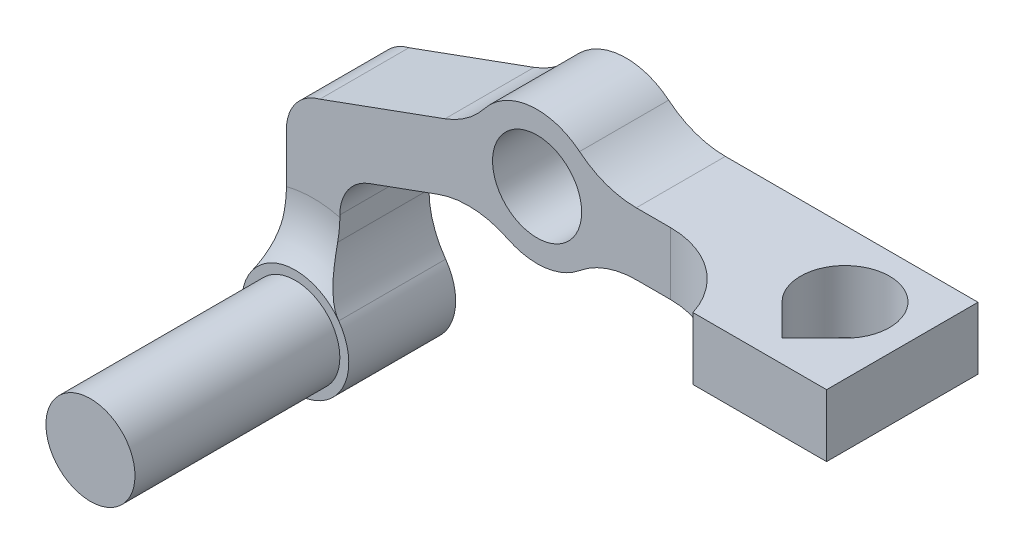
ISO-10303-21;
HEADER;
FILE_DESCRIPTION(('STEP AP214'),'2;1');
FILE_NAME('part.step','',(''),(''),'','','');
FILE_SCHEMA(('AUTOMOTIVE_DESIGN { 1 0 10303 214 1 1 1 1 }'));
ENDSEC;
DATA;
#1=APPLICATION_CONTEXT('core data for automotive mechanical design processes');
#2=APPLICATION_PROTOCOL_DEFINITION('international standard','automotive_design',2000,#1);
#3=PRODUCT_CONTEXT('',#1,'mechanical');
#4=PRODUCT('Part','Part','',(#3));
#5=PRODUCT_RELATED_PRODUCT_CATEGORY('part','',(#4));
#6=PRODUCT_DEFINITION_FORMATION('','',#4);
#7=PRODUCT_DEFINITION_CONTEXT('part definition',#1,'design');
#8=PRODUCT_DEFINITION('design','',#6,#7);
#9=PRODUCT_DEFINITION_SHAPE('','',#8);
#10=(LENGTH_UNIT() NAMED_UNIT(*) SI_UNIT(.MILLI.,.METRE.));
#11=(NAMED_UNIT(*) PLANE_ANGLE_UNIT() SI_UNIT($,.RADIAN.));
#12=(NAMED_UNIT(*) SI_UNIT($,.STERADIAN.) SOLID_ANGLE_UNIT());
#13=UNCERTAINTY_MEASURE_WITH_UNIT(LENGTH_MEASURE(1.E-05),#10,'distance_accuracy_value','');
#14=(GEOMETRIC_REPRESENTATION_CONTEXT(3) GLOBAL_UNCERTAINTY_ASSIGNED_CONTEXT((#13)) GLOBAL_UNIT_ASSIGNED_CONTEXT((#10,
#11,#12)) REPRESENTATION_CONTEXT('',''));
#15=CARTESIAN_POINT('',(0.,0.,0.));
#16=DIRECTION('',(0.,0.,1.));
#17=DIRECTION('',(1.,0.,0.));
#18=AXIS2_PLACEMENT_3D('',#15,#16,#17);
#19=CARTESIAN_POINT('',(-22.1430839676829,-3.69545322482756,5.));
#20=DIRECTION('',(-1.,0.,0.));
#21=DIRECTION('',(0.,0.,1.));
#22=AXIS2_PLACEMENT_3D('',#19,#20,#21);
#23=PLANE('',#22);
#24=DIRECTION('',(0.,-1.,0.));
#25=VECTOR('',#24,1.);
#26=CARTESIAN_POINT('',(-22.1430839676829,-3.69545322482756,-5.));
#27=LINE('',#26,#25);
#28=CARTESIAN_POINT('',(-22.1430839676829,-13.8292024167432,-5.));
#29=VERTEX_POINT('',#28);
#30=CARTESIAN_POINT('',(-22.1430839676829,-16.3680741717387,-5.));
#31=VERTEX_POINT('',#30);
#32=EDGE_CURVE('E254',#29,#31,#27,.T.);
#33=ORIENTED_EDGE('',*,*,#32,.F.);
#34=DIRECTION('',(0.,0.,-1.));
#35=VECTOR('',#34,1.);
#36=CARTESIAN_POINT('',(-22.1430839676829,-13.8292024167432,5.));
#37=LINE('',#36,#35);
#38=CARTESIAN_POINT('',(-22.1430839676829,-13.8292024167432,5.));
#39=VERTEX_POINT('',#38);
#40=EDGE_CURVE('E387',#29,#39,#37,.F.);
#41=ORIENTED_EDGE('',*,*,#40,.T.);
#42=DIRECTION('',(0.,-1.,0.));
#43=VECTOR('',#42,1.);
#44=CARTESIAN_POINT('',(-22.1430839676829,-3.69545322482756,5.));
#45=LINE('',#44,#43);
#46=CARTESIAN_POINT('',(-22.1430839676829,-14.0765031862053,5.));
#47=VERTEX_POINT('',#46);
#48=EDGE_CURVE('E246',#39,#47,#45,.T.);
#49=ORIENTED_EDGE('',*,*,#48,.T.);
#50=CARTESIAN_POINT('',(-22.1430839676829,-14.0765031862053,5.));
#51=CARTESIAN_POINT('',(-22.1430839676829,-14.2691995042129,4.99999296832467));
#52=CARTESIAN_POINT('',(-22.1430839676829,-14.4618891802004,5.00522150807399));
#53=CARTESIAN_POINT('',(-22.1430839676829,-14.8461744157324,5.02597031011278));
#54=CARTESIAN_POINT('',(-22.1430839676829,-15.0377715280384,5.04146176461505));
#55=CARTESIAN_POINT('',(-22.1430839676829,-15.4198609475846,5.08255728156386));
#56=CARTESIAN_POINT('',(-22.1430839676829,-15.6103533299134,5.10816064832956));
#57=CARTESIAN_POINT('',(-22.1430839676829,-15.9902762887036,5.16935417384789));
#58=CARTESIAN_POINT('',(-22.1430839676829,-16.179702392601,5.2049721228449));
#59=CARTESIAN_POINT('',(-22.1430839676829,-16.3680741717387,5.24546180964034));
#60=B_SPLINE_CURVE_WITH_KNOTS('',3,(#50,#51,#52,#53,#54,#55,#56,#57,#58,#59),.UNSPECIFIED.,.F.,
.F.,(4,2,2,2,4),(0.,0.578008357561275,1.15440109343331,1.73075418145786,2.30872269509582),.UNSPECIFIED.);
#61=CARTESIAN_POINT('',(-22.1430839676829,-16.3680741717387,5.24546180964034));
#62=VERTEX_POINT('',#61);
#63=EDGE_CURVE('E334',#47,#62,#60,.T.);
#64=ORIENTED_EDGE('',*,*,#63,.T.);
#65=DIRECTION('',(0.,0.,1.));
#66=VECTOR('',#65,1.);
#67=CARTESIAN_POINT('',(-22.1430839676829,-16.3680741717387,-5.));
#68=LINE('',#67,#66);
#69=EDGE_CURVE('E311',#62,#31,#68,.F.);
#70=ORIENTED_EDGE('',*,*,#69,.T.);
#71=EDGE_LOOP('',(#33,#41,#49,#64,#70));
#72=FACE_BOUND('',#71,.T.);
#73=ADVANCED_FACE('F39',(#72),#23,.F.);
#74=CARTESIAN_POINT('',(-28.1430839676829,-3.69545322482756,5.));
#75=DIRECTION('',(1.,0.,0.));
#76=DIRECTION('',(0.,0.,-1.));
#77=AXIS2_PLACEMENT_3D('',#74,#75,#76);
#78=PLANE('',#77);
#79=DIRECTION('',(0.,-1.,0.));
#80=VECTOR('',#79,1.);
#81=CARTESIAN_POINT('',(-28.1430839676829,-3.69545322482756,5.));
#82=LINE('',#81,#80);
#83=CARTESIAN_POINT('',(-28.1430839676829,-8.53838025386968,5.));
#84=VERTEX_POINT('',#83);
#85=CARTESIAN_POINT('',(-28.1430839676829,-14.0765031862053,5.));
#86=VERTEX_POINT('',#85);
#87=EDGE_CURVE('E250',#84,#86,#82,.T.);
#88=ORIENTED_EDGE('',*,*,#87,.F.);
#89=DIRECTION('',(0.,0.,-1.));
#90=VECTOR('',#89,1.);
#91=CARTESIAN_POINT('',(-28.1430839676829,-8.53838025386968,5.));
#92=LINE('',#91,#90);
#93=CARTESIAN_POINT('',(-28.1430839676829,-8.53838025386968,-5.));
#94=VERTEX_POINT('',#93);
#95=EDGE_CURVE('E47',#84,#94,#92,.T.);
#96=ORIENTED_EDGE('',*,*,#95,.T.);
#97=DIRECTION('',(0.,-1.,0.));
#98=VECTOR('',#97,1.);
#99=CARTESIAN_POINT('',(-28.1430839676829,-3.69545322482756,-5.));
#100=LINE('',#99,#98);
#101=CARTESIAN_POINT('',(-28.1430839676829,-16.3680741717387,-5.));
#102=VERTEX_POINT('',#101);
#103=EDGE_CURVE('E252',#94,#102,#100,.T.);
#104=ORIENTED_EDGE('',*,*,#103,.T.);
#105=DIRECTION('',(0.,0.,1.));
#106=VECTOR('',#105,1.);
#107=CARTESIAN_POINT('',(-28.1430839676829,-16.3680741717387,5.));
#108=LINE('',#107,#106);
#109=CARTESIAN_POINT('',(-28.1430839676829,-16.3680741717387,5.24546180964034));
#110=VERTEX_POINT('',#109);
#111=EDGE_CURVE('E309',#102,#110,#108,.T.);
#112=ORIENTED_EDGE('',*,*,#111,.T.);
#113=CARTESIAN_POINT('',(-28.1430839676829,-16.3680741717387,5.24546180964034));
#114=CARTESIAN_POINT('',(-28.1430839676829,-16.179702392601,5.2049721228449));
#115=CARTESIAN_POINT('',(-28.1430839676829,-15.9902762887036,5.16935417384789));
#116=CARTESIAN_POINT('',(-28.1430839676829,-15.6103533299134,5.10816064832956));
#117=CARTESIAN_POINT('',(-28.1430839676829,-15.4198609475846,5.08255728156386));
#118=CARTESIAN_POINT('',(-28.1430839676829,-15.0377715280384,5.04146176461504));
#119=CARTESIAN_POINT('',(-28.1430839676829,-14.8461744157324,5.02597031011277));
#120=CARTESIAN_POINT('',(-28.1430839676829,-14.4618891802004,5.00522150807399));
#121=CARTESIAN_POINT('',(-28.1430839676829,-14.2691995042129,4.99999296832467));
#122=CARTESIAN_POINT('',(-28.1430839676829,-14.0765031862053,5.));
#123=B_SPLINE_CURVE_WITH_KNOTS('',3,(#113,#114,#115,#116,#117,#118,#119,#120,#121,#122),
.UNSPECIFIED.,.F.,.F.,(4,2,2,2,4),(0.,0.577968513637955,1.15432160166251,1.73071433753454,
2.30872269509582),.UNSPECIFIED.);
#124=EDGE_CURVE('E343',#110,#86,#123,.T.);
#125=ORIENTED_EDGE('',*,*,#124,.T.);
#126=EDGE_LOOP('',(#88,#96,#104,#112,#125));
#127=FACE_BOUND('',#126,.T.);
#128=ADVANCED_FACE('F463',(#127),#78,.F.);
#129=CARTESIAN_POINT('',(-4.21246842953902,-3.80195438773918,-5.));
#130=DIRECTION('',(0.342020143325669,-0.939692620785908,0.));
#131=DIRECTION('',(0.939692620785908,0.342020143325669,0.));
#132=AXIS2_PLACEMENT_3D('',#129,#130,#131);
#133=PLANE('',#132);
#134=DIRECTION('',(-0.939692620785908,-0.342020143325669,0.));
#135=VECTOR('',#134,1.);
#136=CARTESIAN_POINT('',(-4.21246842953902,-3.80195438773918,5.));
#137=LINE('',#136,#135);
#138=CARTESIAN_POINT('',(-11.1223924767804,-6.3169610619753,5.));
#139=VERTEX_POINT('',#138);
#140=CARTESIAN_POINT('',(-18.8531846843113,-9.13073931281365,5.));
#141=VERTEX_POINT('',#140);
#142=EDGE_CURVE('E267',#139,#141,#137,.T.);
#143=ORIENTED_EDGE('',*,*,#142,.T.);
#144=DIRECTION('',(0.,0.,-1.));
#145=VECTOR('',#144,1.);
#146=CARTESIAN_POINT('',(-18.8531846843113,-9.13073931281365,-5.));
#147=LINE('',#146,#145);
#148=CARTESIAN_POINT('',(-18.8531846843113,-9.13073931281365,-5.));
#149=VERTEX_POINT('',#148);
#150=EDGE_CURVE('E384',#141,#149,#147,.T.);
#151=ORIENTED_EDGE('',*,*,#150,.T.);
#152=DIRECTION('',(-0.939692620785908,-0.342020143325669,0.));
#153=VECTOR('',#152,1.);
#154=CARTESIAN_POINT('',(-4.21246842953902,-3.80195438773918,-5.));
#155=LINE('',#154,#153);
#156=CARTESIAN_POINT('',(-11.1223924767804,-6.3169610619753,-5.));
#157=VERTEX_POINT('',#156);
#158=EDGE_CURVE('E271',#157,#149,#155,.T.);
#159=ORIENTED_EDGE('',*,*,#158,.F.);
#160=DIRECTION('',(0.,0.,-1.));
#161=VECTOR('',#160,1.);
#162=CARTESIAN_POINT('',(-11.1223924767804,-6.3169610619753,-5.));
#163=LINE('',#162,#161);
#164=EDGE_CURVE('E319',#157,#139,#163,.F.);
#165=ORIENTED_EDGE('',*,*,#164,.T.);
#166=EDGE_LOOP('',(#143,#151,#159,#165));
#167=FACE_BOUND('',#166,.T.);
#168=ADVANCED_FACE('F404',(#167),#133,.T.);
#169=CARTESIAN_POINT('',(-6.60660943281871,2.77589395776218,-5.));
#170=DIRECTION('',(-0.342020143325669,0.939692620785908,0.));
#171=DIRECTION('',(-0.939692620785908,-0.342020143325669,0.));
#172=AXIS2_PLACEMENT_3D('',#169,#170,#171);
#173=PLANE('',#172);
#174=DIRECTION('',(-0.939692620785908,-0.342020143325669,0.));
#175=VECTOR('',#174,1.);
#176=CARTESIAN_POINT('',(-6.60660943281871,2.77589395776218,5.));
#177=LINE('',#176,#175);
#178=CARTESIAN_POINT('',(-10.3382060479147,1.41770386357871,5.));
#179=VERTEX_POINT('',#178);
#180=CARTESIAN_POINT('',(-24.3864896904353,-3.69545322482756,5.));
#181=VERTEX_POINT('',#180);
#182=EDGE_CURVE('E264',#179,#181,#177,.T.);
#183=ORIENTED_EDGE('',*,*,#182,.F.);
#184=DIRECTION('',(0.,0.,-1.));
#185=VECTOR('',#184,1.);
#186=CARTESIAN_POINT('',(-10.3382060479147,1.41770386357871,-5.));
#187=LINE('',#186,#185);
#188=CARTESIAN_POINT('',(-10.3382060479147,1.41770386357871,-5.));
#189=VERTEX_POINT('',#188);
#190=EDGE_CURVE('E332',#179,#189,#187,.T.);
#191=ORIENTED_EDGE('',*,*,#190,.T.);
#192=DIRECTION('',(-0.939692620785908,-0.342020143325669,0.));
#193=VECTOR('',#192,1.);
#194=CARTESIAN_POINT('',(-6.60660943281871,2.77589395776218,-5.));
#195=LINE('',#194,#193);
#196=CARTESIAN_POINT('',(-24.3864896904352,-3.69545322482756,-5.));
#197=VERTEX_POINT('',#196);
#198=EDGE_CURVE('E274',#189,#197,#195,.T.);
#199=ORIENTED_EDGE('',*,*,#198,.T.);
#200=DIRECTION('',(0.,0.,1.));
#201=VECTOR('',#200,1.);
#202=CARTESIAN_POINT('',(-24.3864896904353,-3.69545322482756,-4.99999999999998));
#203=LINE('',#202,#201);
#204=EDGE_CURVE('E291',#197,#181,#203,.T.);
#205=ORIENTED_EDGE('',*,*,#204,.T.);
#206=EDGE_LOOP('',(#183,#191,#199,#205));
#207=FACE_BOUND('',#206,.T.);
#208=ADVANCED_FACE('F457',(#207),#173,.T.);
#209=CARTESIAN_POINT('',(0.,0.,5.));
#210=DIRECTION('',(0.,0.,-1.));
#211=DIRECTION('',(-1.,0.,0.));
#212=AXIS2_PLACEMENT_3D('',#209,#210,#211);
#213=CYLINDRICAL_SURFACE('',#212,7.5);
#214=CARTESIAN_POINT('',(0.,0.,5.));
#215=DIRECTION('',(0.,0.,1.));
#216=DIRECTION('',(1.,0.,0.));
#217=AXIS2_PLACEMENT_3D('',#214,#215,#216);
#218=CIRCLE('',#217,7.5);
#219=CARTESIAN_POINT('',(-3.30093901865302,-6.73452311564331,5.));
#220=VERTEX_POINT('',#219);
#221=CARTESIAN_POINT('',(4.7723694538543,-5.78571428571428,5.));
#222=VERTEX_POINT('',#221);
#223=EDGE_CURVE('E287',#220,#222,#218,.T.);
#224=ORIENTED_EDGE('',*,*,#223,.F.);
#225=DIRECTION('',(0.,0.,-1.));
#226=VECTOR('',#225,1.);
#227=CARTESIAN_POINT('',(-3.30093901865302,-6.73452311564331,5.));
#228=LINE('',#227,#226);
#229=CARTESIAN_POINT('',(-3.30093901865302,-6.73452311564331,-5.));
#230=VERTEX_POINT('',#229);
#231=EDGE_CURVE('E316',#220,#230,#228,.T.);
#232=ORIENTED_EDGE('',*,*,#231,.T.);
#233=CARTESIAN_POINT('',(0.,0.,-5.));
#234=DIRECTION('',(0.,0.,1.));
#235=DIRECTION('',(1.,0.,0.));
#236=AXIS2_PLACEMENT_3D('',#233,#234,#235);
#237=CIRCLE('',#236,7.5);
#238=CARTESIAN_POINT('',(4.7723694538543,-5.78571428571428,-5.));
#239=VERTEX_POINT('',#238);
#240=EDGE_CURVE('E288',#230,#239,#237,.T.);
#241=ORIENTED_EDGE('',*,*,#240,.T.);
#242=DIRECTION('',(0.,0.,-1.));
#243=VECTOR('',#242,1.);
#244=CARTESIAN_POINT('',(4.7723694538543,-5.78571428571428,5.));
#245=LINE('',#244,#243);
#246=EDGE_CURVE('E314',#239,#222,#245,.F.);
#247=ORIENTED_EDGE('',*,*,#246,.T.);
#248=EDGE_LOOP('',(#224,#232,#241,#247));
#249=FACE_BOUND('',#248,.T.);
#250=ADVANCED_FACE('F559',(#249),#213,.T.);
#251=CARTESIAN_POINT('',(0.,0.,5.));
#252=DIRECTION('',(0.,0.,1.));
#253=DIRECTION('',(1.,0.,0.));
#254=AXIS2_PLACEMENT_3D('',#251,#252,#253);
#255=PLANE('',#254);
#256=ORIENTED_EDGE('',*,*,#182,.T.);
#257=CARTESIAN_POINT('',(-23.1430839676829,-8.53838025386968,5.));
#258=DIRECTION('',(0.,0.,1.));
#259=DIRECTION('',(1.,0.,0.));
#260=AXIS2_PLACEMENT_3D('',#257,#258,#259);
#261=CIRCLE('',#260,5.);
#262=EDGE_CURVE('E61',#181,#84,#261,.T.);
#263=ORIENTED_EDGE('',*,*,#262,.T.);
#264=ORIENTED_EDGE('',*,*,#87,.T.);
#265=CARTESIAN_POINT('',(-25.1430839676829,-25.6954532248276,5.));
#266=DIRECTION('',(0.,0.,1.));
#267=DIRECTION('',(1.,0.,0.));
#268=AXIS2_PLACEMENT_3D('',#265,#266,#267);
#269=CIRCLE('',#268,12.);
#270=EDGE_CURVE('E302',#86,#47,#269,.F.);
#271=ORIENTED_EDGE('',*,*,#270,.T.);
#272=ORIENTED_EDGE('',*,*,#48,.F.);
#273=CARTESIAN_POINT('',(-17.1430839676829,-13.8292024167432,5.));
#274=DIRECTION('',(0.,0.,1.));
#275=DIRECTION('',(1.,0.,0.));
#276=AXIS2_PLACEMENT_3D('',#273,#274,#275);
#277=CIRCLE('',#276,5.);
#278=EDGE_CURVE('E392',#39,#141,#277,.F.);
#279=ORIENTED_EDGE('',*,*,#278,.T.);
#280=ORIENTED_EDGE('',*,*,#142,.F.);
#281=CARTESIAN_POINT('',(-7.70219104352372,-15.7138872698344,5.));
#282=DIRECTION('',(0.,0.,1.));
#283=DIRECTION('',(1.,0.,0.));
#284=AXIS2_PLACEMENT_3D('',#281,#282,#283);
#285=CIRCLE('',#284,10.);
#286=EDGE_CURVE('E432',#139,#220,#285,.F.);
#287=ORIENTED_EDGE('',*,*,#286,.T.);
#288=ORIENTED_EDGE('',*,*,#223,.T.);
#289=CARTESIAN_POINT('',(11.13552872566,-13.5,5.));
#290=DIRECTION('',(0.,0.,1.));
#291=DIRECTION('',(1.,0.,0.));
#292=AXIS2_PLACEMENT_3D('',#289,#290,#291);
#293=CIRCLE('',#292,10.);
#294=CARTESIAN_POINT('',(11.13552872566,-3.5,5.));
#295=VERTEX_POINT('',#294);
#296=EDGE_CURVE('E436',#222,#295,#293,.F.);
#297=ORIENTED_EDGE('',*,*,#296,.T.);
#298=DIRECTION('',(1.,0.,0.));
#299=VECTOR('',#298,1.);
#300=CARTESIAN_POINT('',(-26.3411544693228,-3.5,5.));
#301=LINE('',#300,#299);
#302=CARTESIAN_POINT('',(14.9606079858305,-3.5,5.));
#303=VERTEX_POINT('',#302);
#304=EDGE_CURVE('E259',#295,#303,#301,.T.);
#305=ORIENTED_EDGE('',*,*,#304,.T.);
#306=DIRECTION('',(0.,1.,0.));
#307=VECTOR('',#306,1.);
#308=CARTESIAN_POINT('',(14.9606079858305,3.5,5.));
#309=LINE('',#308,#307);
#310=CARTESIAN_POINT('',(14.9606079858305,3.5,5.));
#311=VERTEX_POINT('',#310);
#312=EDGE_CURVE('E300',#303,#311,#309,.T.);
#313=ORIENTED_EDGE('',*,*,#312,.T.);
#314=DIRECTION('',(1.,0.,0.));
#315=VECTOR('',#314,1.);
#316=CARTESIAN_POINT('',(-26.3411544693228,3.5,5.));
#317=LINE('',#316,#315);
#318=CARTESIAN_POINT('',(11.13552872566,3.5,5.));
#319=VERTEX_POINT('',#318);
#320=EDGE_CURVE('E260',#319,#311,#317,.T.);
#321=ORIENTED_EDGE('',*,*,#320,.F.);
#322=CARTESIAN_POINT('',(11.13552872566,13.5,5.));
#323=DIRECTION('',(0.,0.,1.));
#324=DIRECTION('',(1.,0.,0.));
#325=AXIS2_PLACEMENT_3D('',#322,#323,#324);
#326=CIRCLE('',#325,10.);
#327=CARTESIAN_POINT('',(4.7723694538543,5.78571428571429,5.));
#328=VERTEX_POINT('',#327);
#329=EDGE_CURVE('E438',#319,#328,#326,.F.);
#330=ORIENTED_EDGE('',*,*,#329,.T.);
#331=CARTESIAN_POINT('',(-5.89646034907346,4.63484145918762,5.));
#332=VERTEX_POINT('',#331);
#333=EDGE_CURVE('E284',#328,#332,#218,.T.);
#334=ORIENTED_EDGE('',*,*,#333,.T.);
#335=CARTESIAN_POINT('',(-13.7584074811714,10.8146300714378,5.));
#336=DIRECTION('',(0.,0.,1.));
#337=DIRECTION('',(1.,0.,0.));
#338=AXIS2_PLACEMENT_3D('',#335,#336,#337);
#339=CIRCLE('',#338,10.);
#340=EDGE_CURVE('E442',#332,#179,#339,.F.);
#341=ORIENTED_EDGE('',*,*,#340,.T.);
#342=EDGE_LOOP('',(#256,#263,#264,#271,#272,#279,#280,#287,#288,#297,#305,#313,#321,#330,#334,#341));
#343=FACE_BOUND('',#342,.T.);
#344=CARTESIAN_POINT('',(0.,0.,5.));
#345=DIRECTION('',(0.,0.,1.));
#346=DIRECTION('',(1.,0.,0.));
#347=AXIS2_PLACEMENT_3D('',#344,#345,#346);
#348=CIRCLE('',#347,5.);
#349=CARTESIAN_POINT('',(5.,0.,5.));
#350=VERTEX_POINT('',#349);
#351=EDGE_CURVE('E278',#350,#350,#348,.T.);
#352=ORIENTED_EDGE('',*,*,#351,.F.);
#353=EDGE_LOOP('',(#352));
#354=FACE_BOUND('',#353,.T.);
#355=ADVANCED_FACE('F397',(#343,#354),#255,.T.);
#356=CARTESIAN_POINT('',(0.,0.,-5.));
#357=DIRECTION('',(0.,0.,1.));
#358=DIRECTION('',(1.,0.,0.));
#359=AXIS2_PLACEMENT_3D('',#356,#357,#358);
#360=PLANE('',#359);
#361=ORIENTED_EDGE('',*,*,#103,.F.);
#362=CARTESIAN_POINT('',(-23.1430839676829,-8.53838025386968,-5.));
#363=DIRECTION('',(0.,0.,1.));
#364=DIRECTION('',(1.,0.,0.));
#365=AXIS2_PLACEMENT_3D('',#362,#363,#364);
#366=CIRCLE('',#365,5.);
#367=EDGE_CURVE('E11',#94,#197,#366,.F.);
#368=ORIENTED_EDGE('',*,*,#367,.T.);
#369=ORIENTED_EDGE('',*,*,#198,.F.);
#370=CARTESIAN_POINT('',(-13.7584074811714,10.8146300714378,-5.));
#371=DIRECTION('',(0.,0.,1.));
#372=DIRECTION('',(1.,0.,0.));
#373=AXIS2_PLACEMENT_3D('',#370,#371,#372);
#374=CIRCLE('',#373,10.);
#375=CARTESIAN_POINT('',(-5.89646034907346,4.63484145918762,-5.));
#376=VERTEX_POINT('',#375);
#377=EDGE_CURVE('E388',#189,#376,#374,.T.);
#378=ORIENTED_EDGE('',*,*,#377,.T.);
#379=CARTESIAN_POINT('',(4.7723694538543,5.78571428571429,-5.));
#380=VERTEX_POINT('',#379);
#381=EDGE_CURVE('E281',#380,#376,#237,.T.);
#382=ORIENTED_EDGE('',*,*,#381,.F.);
#383=CARTESIAN_POINT('',(11.13552872566,13.5,-5.));
#384=DIRECTION('',(0.,0.,1.));
#385=DIRECTION('',(1.,0.,0.));
#386=AXIS2_PLACEMENT_3D('',#383,#384,#385);
#387=CIRCLE('',#386,10.);
#388=CARTESIAN_POINT('',(11.13552872566,3.5,-5.));
#389=VERTEX_POINT('',#388);
#390=EDGE_CURVE('E440',#380,#389,#387,.T.);
#391=ORIENTED_EDGE('',*,*,#390,.T.);
#392=DIRECTION('',(1.,0.,0.));
#393=VECTOR('',#392,1.);
#394=CARTESIAN_POINT('',(-26.3411544693228,3.5,-5.));
#395=LINE('',#394,#393);
#396=CARTESIAN_POINT('',(39.5,3.5,-5.));
#397=VERTEX_POINT('',#396);
#398=EDGE_CURVE('E257',#389,#397,#395,.T.);
#399=ORIENTED_EDGE('',*,*,#398,.T.);
#400=DIRECTION('',(0.,-1.,0.));
#401=VECTOR('',#400,1.);
#402=CARTESIAN_POINT('',(39.5,3.5,-5.));
#403=LINE('',#402,#401);
#404=CARTESIAN_POINT('',(39.5,-3.5,-5.));
#405=VERTEX_POINT('',#404);
#406=EDGE_CURVE('E226',#397,#405,#403,.T.);
#407=ORIENTED_EDGE('',*,*,#406,.T.);
#408=DIRECTION('',(1.,0.,0.));
#409=VECTOR('',#408,1.);
#410=CARTESIAN_POINT('',(-26.3411544693228,-3.5,-5.));
#411=LINE('',#410,#409);
#412=CARTESIAN_POINT('',(11.13552872566,-3.5,-5.));
#413=VERTEX_POINT('',#412);
#414=EDGE_CURVE('E256',#413,#405,#411,.T.);
#415=ORIENTED_EDGE('',*,*,#414,.F.);
#416=CARTESIAN_POINT('',(11.13552872566,-13.5,-5.));
#417=DIRECTION('',(0.,0.,1.));
#418=DIRECTION('',(1.,0.,0.));
#419=AXIS2_PLACEMENT_3D('',#416,#417,#418);
#420=CIRCLE('',#419,10.);
#421=EDGE_CURVE('E434',#413,#239,#420,.T.);
#422=ORIENTED_EDGE('',*,*,#421,.T.);
#423=ORIENTED_EDGE('',*,*,#240,.F.);
#424=CARTESIAN_POINT('',(-7.70219104352372,-15.7138872698344,-5.));
#425=DIRECTION('',(0.,0.,1.));
#426=DIRECTION('',(1.,0.,0.));
#427=AXIS2_PLACEMENT_3D('',#424,#425,#426);
#428=CIRCLE('',#427,10.);
#429=EDGE_CURVE('E430',#230,#157,#428,.T.);
#430=ORIENTED_EDGE('',*,*,#429,.T.);
#431=ORIENTED_EDGE('',*,*,#158,.T.);
#432=CARTESIAN_POINT('',(-17.1430839676829,-13.8292024167432,-5.));
#433=DIRECTION('',(0.,0.,1.));
#434=DIRECTION('',(1.,0.,0.));
#435=AXIS2_PLACEMENT_3D('',#432,#433,#434);
#436=CIRCLE('',#435,5.);
#437=EDGE_CURVE('E390',#149,#29,#436,.T.);
#438=ORIENTED_EDGE('',*,*,#437,.T.);
#439=ORIENTED_EDGE('',*,*,#32,.T.);
#440=CARTESIAN_POINT('',(-12.1430839676829,-16.3680741717387,-5.));
#441=DIRECTION('',(0.,0.,1.));
#442=DIRECTION('',(1.,0.,0.));
#443=AXIS2_PLACEMENT_3D('',#440,#441,#442);
#444=CIRCLE('',#443,10.);
#445=CARTESIAN_POINT('',(-20.2680839676829,-22.1976860799192,-5.));
#446=VERTEX_POINT('',#445);
#447=EDGE_CURVE('E419',#31,#446,#444,.T.);
#448=ORIENTED_EDGE('',*,*,#447,.T.);
#449=CARTESIAN_POINT('',(-25.1430839676829,-25.6954532248276,-5.));
#450=DIRECTION('',(0.,0.,1.));
#451=DIRECTION('',(1.,0.,0.));
#452=AXIS2_PLACEMENT_3D('',#449,#450,#451);
#453=CIRCLE('',#452,6.);
#454=CARTESIAN_POINT('',(-30.0180839676829,-22.1976860799192,-5.));
#455=VERTEX_POINT('',#454);
#456=EDGE_CURVE('E477',#455,#446,#453,.T.);
#457=ORIENTED_EDGE('',*,*,#456,.F.);
#458=CARTESIAN_POINT('',(-38.1430839676829,-16.3680741717387,-5.));
#459=DIRECTION('',(0.,0.,1.));
#460=DIRECTION('',(1.,0.,0.));
#461=AXIS2_PLACEMENT_3D('',#458,#459,#460);
#462=CIRCLE('',#461,10.);
#463=EDGE_CURVE('E423',#455,#102,#462,.T.);
#464=ORIENTED_EDGE('',*,*,#463,.T.);
#465=EDGE_LOOP('',(#361,#368,#369,#378,#382,#391,#399,#407,#415,#422,#423,#430,#431,#438,#439,
#448,#457,#464));
#466=FACE_BOUND('',#465,.T.);
#467=CARTESIAN_POINT('',(0.,0.,-5.));
#468=DIRECTION('',(0.,0.,1.));
#469=DIRECTION('',(1.,0.,0.));
#470=AXIS2_PLACEMENT_3D('',#467,#468,#469);
#471=CIRCLE('',#470,5.);
#472=CARTESIAN_POINT('',(5.,0.,-5.));
#473=VERTEX_POINT('',#472);
#474=EDGE_CURVE('E270',#473,#473,#471,.T.);
#475=ORIENTED_EDGE('',*,*,#474,.T.);
#476=EDGE_LOOP('',(#475));
#477=FACE_BOUND('',#476,.T.);
#478=ADVANCED_FACE('F410',(#466,#477),#360,.F.);
#479=ORIENTED_EDGE('',*,*,#333,.F.);
#480=DIRECTION('',(0.,0.,-1.));
#481=VECTOR('',#480,1.);
#482=CARTESIAN_POINT('',(4.7723694538543,5.78571428571429,5.));
#483=LINE('',#482,#481);
#484=EDGE_CURVE('E330',#328,#380,#483,.T.);
#485=ORIENTED_EDGE('',*,*,#484,.T.);
#486=ORIENTED_EDGE('',*,*,#381,.T.);
#487=DIRECTION('',(0.,0.,-1.));
#488=VECTOR('',#487,1.);
#489=CARTESIAN_POINT('',(-5.89646034907346,4.63484145918762,5.));
#490=LINE('',#489,#488);
#491=EDGE_CURVE('E327',#376,#332,#490,.F.);
#492=ORIENTED_EDGE('',*,*,#491,.T.);
#493=EDGE_LOOP('',(#479,#485,#486,#492));
#494=FACE_BOUND('',#493,.T.);
#495=ADVANCED_FACE('F452',(#494),#213,.T.);
#496=CARTESIAN_POINT('',(0.,0.,5.));
#497=DIRECTION('',(0.,0.,-1.));
#498=DIRECTION('',(-1.,0.,0.));
#499=AXIS2_PLACEMENT_3D('',#496,#497,#498);
#500=CYLINDRICAL_SURFACE('',#499,5.);
#501=ORIENTED_EDGE('',*,*,#351,.T.);
#502=EDGE_LOOP('',(#501));
#503=FACE_BOUND('',#502,.T.);
#504=ORIENTED_EDGE('',*,*,#474,.F.);
#505=EDGE_LOOP('',(#504));
#506=FACE_BOUND('',#505,.T.);
#507=ADVANCED_FACE('F571',(#503,#506),#500,.F.);
#508=CARTESIAN_POINT('',(-26.3411544693228,-3.5,5.));
#509=DIRECTION('',(0.,-1.,0.));
#510=DIRECTION('',(0.,0.,-1.));
#511=AXIS2_PLACEMENT_3D('',#508,#509,#510);
#512=PLANE('',#511);
#513=DIRECTION('',(-0.707106781186549,0.,0.707106781186546));
#514=VECTOR('',#513,1.);
#515=CARTESIAN_POINT('',(32.,-3.5,9.5));
#516=LINE('',#515,#514);
#517=CARTESIAN_POINT('',(35.5355339059327,-3.5,5.96446609406728));
#518=VERTEX_POINT('',#517);
#519=CARTESIAN_POINT('',(32.,-3.5,9.50000000000001));
#520=VERTEX_POINT('',#519);
#521=EDGE_CURVE('E218',#518,#520,#516,.T.);
#522=ORIENTED_EDGE('',*,*,#521,.F.);
#523=CARTESIAN_POINT('',(32.,-3.5,2.42893218813453));
#524=DIRECTION('',(0.,-1.,0.));
#525=DIRECTION('',(0.,0.,-1.));
#526=AXIS2_PLACEMENT_3D('',#523,#524,#525);
#527=CIRCLE('',#526,5.);
#528=CARTESIAN_POINT('',(28.4644660940673,-3.5,5.96446609406728));
#529=VERTEX_POINT('',#528);
#530=EDGE_CURVE('E203',#529,#518,#527,.T.);
#531=ORIENTED_EDGE('',*,*,#530,.F.);
#532=DIRECTION('',(-0.707106781186549,0.,-0.707106781186547));
#533=VECTOR('',#532,1.);
#534=CARTESIAN_POINT('',(32.,-3.5,9.5));
#535=LINE('',#534,#533);
#536=EDGE_CURVE('E214',#520,#529,#535,.T.);
#537=ORIENTED_EDGE('',*,*,#536,.F.);
#538=EDGE_LOOP('',(#522,#531,#537));
#539=FACE_BOUND('',#538,.T.);
#540=ORIENTED_EDGE('',*,*,#304,.F.);
#541=DIRECTION('',(0.,0.,-1.));
#542=VECTOR('',#541,1.);
#543=CARTESIAN_POINT('',(11.13552872566,-3.5,5.));
#544=LINE('',#543,#542);
#545=EDGE_CURVE('E321',#295,#413,#544,.T.);
#546=ORIENTED_EDGE('',*,*,#545,.T.);
#547=ORIENTED_EDGE('',*,*,#414,.T.);
#548=DIRECTION('',(0.,0.,-1.));
#549=VECTOR('',#548,1.);
#550=CARTESIAN_POINT('',(39.5,-3.5,12.));
#551=LINE('',#550,#549);
#552=CARTESIAN_POINT('',(39.5,-3.5,12.));
#553=VERTEX_POINT('',#552);
#554=EDGE_CURVE('E243',#553,#405,#551,.T.);
#555=ORIENTED_EDGE('',*,*,#554,.F.);
#556=DIRECTION('',(-1.,0.,0.));
#557=VECTOR('',#556,1.);
#558=CARTESIAN_POINT('',(39.5,-3.5,12.));
#559=LINE('',#558,#557);
#560=CARTESIAN_POINT('',(24.5,-3.5,12.));
#561=VERTEX_POINT('',#560);
#562=EDGE_CURVE('E237',#553,#561,#559,.T.);
#563=ORIENTED_EDGE('',*,*,#562,.T.);
#564=CARTESIAN_POINT('',(14.9606079858305,-3.5,15.));
#565=DIRECTION('',(0.,-1.,0.));
#566=DIRECTION('',(0.,0.,-1.));
#567=AXIS2_PLACEMENT_3D('',#564,#565,#566);
#568=CIRCLE('',#567,10.);
#569=EDGE_CURVE('E422',#561,#303,#568,.F.);
#570=ORIENTED_EDGE('',*,*,#569,.T.);
#571=EDGE_LOOP('',(#540,#546,#547,#555,#563,#570));
#572=FACE_BOUND('',#571,.T.);
#573=ADVANCED_FACE('F220',(#539,#572),#512,.T.);
#574=CARTESIAN_POINT('',(-26.3411544693228,3.5,5.));
#575=DIRECTION('',(0.,1.,0.));
#576=DIRECTION('',(0.,0.,1.));
#577=AXIS2_PLACEMENT_3D('',#574,#575,#576);
#578=PLANE('',#577);
#579=DIRECTION('',(0.707106781186549,0.,-0.707106781186546));
#580=VECTOR('',#579,1.);
#581=CARTESIAN_POINT('',(5.07942276533849,3.5,36.4205772346614));
#582=LINE('',#581,#580);
#583=CARTESIAN_POINT('',(32.,3.5,9.5));
#584=VERTEX_POINT('',#583);
#585=CARTESIAN_POINT('',(35.5355339059327,3.5,5.96446609406728));
#586=VERTEX_POINT('',#585);
#587=EDGE_CURVE('E297',#584,#586,#582,.T.);
#588=ORIENTED_EDGE('',*,*,#587,.F.);
#589=DIRECTION('',(0.707106781186549,0.,0.707106781186546));
#590=VECTOR('',#589,1.);
#591=CARTESIAN_POINT('',(0.579422765338514,3.5,-21.9205772346614));
#592=LINE('',#591,#590);
#593=CARTESIAN_POINT('',(28.4644660940673,3.5,5.96446609406728));
#594=VERTEX_POINT('',#593);
#595=EDGE_CURVE('E294',#594,#584,#592,.T.);
#596=ORIENTED_EDGE('',*,*,#595,.F.);
#597=CARTESIAN_POINT('',(32.,3.5,2.42893218813453));
#598=DIRECTION('',(0.,1.,0.));
#599=DIRECTION('',(0.,0.,1.));
#600=AXIS2_PLACEMENT_3D('',#597,#598,#599);
#601=CIRCLE('',#600,5.);
#602=EDGE_CURVE('E206',#586,#594,#601,.T.);
#603=ORIENTED_EDGE('',*,*,#602,.F.);
#604=EDGE_LOOP('',(#588,#596,#603));
#605=FACE_BOUND('',#604,.T.);
#606=ORIENTED_EDGE('',*,*,#398,.F.);
#607=DIRECTION('',(0.,0.,-1.));
#608=VECTOR('',#607,1.);
#609=CARTESIAN_POINT('',(11.13552872566,3.5,5.));
#610=LINE('',#609,#608);
#611=EDGE_CURVE('E324',#389,#319,#610,.F.);
#612=ORIENTED_EDGE('',*,*,#611,.T.);
#613=ORIENTED_EDGE('',*,*,#320,.T.);
#614=CARTESIAN_POINT('',(14.9606079858305,3.5,15.));
#615=DIRECTION('',(0.,1.,0.));
#616=DIRECTION('',(0.,0.,1.));
#617=AXIS2_PLACEMENT_3D('',#614,#615,#616);
#618=CIRCLE('',#617,10.);
#619=CARTESIAN_POINT('',(24.5,3.5,12.));
#620=VERTEX_POINT('',#619);
#621=EDGE_CURVE('E425',#311,#620,#618,.F.);
#622=ORIENTED_EDGE('',*,*,#621,.T.);
#623=DIRECTION('',(1.,0.,0.));
#624=VECTOR('',#623,1.);
#625=CARTESIAN_POINT('',(39.5,3.5,12.));
#626=LINE('',#625,#624);
#627=CARTESIAN_POINT('',(39.5,3.5,12.));
#628=VERTEX_POINT('',#627);
#629=EDGE_CURVE('E231',#620,#628,#626,.T.);
#630=ORIENTED_EDGE('',*,*,#629,.T.);
#631=DIRECTION('',(0.,0.,-1.));
#632=VECTOR('',#631,1.);
#633=CARTESIAN_POINT('',(39.5,3.5,12.));
#634=LINE('',#633,#632);
#635=EDGE_CURVE('E240',#628,#397,#634,.T.);
#636=ORIENTED_EDGE('',*,*,#635,.T.);
#637=EDGE_LOOP('',(#606,#612,#613,#622,#630,#636));
#638=FACE_BOUND('',#637,.T.);
#639=ADVANCED_FACE('F520',(#605,#638),#578,.T.);
#640=CARTESIAN_POINT('',(39.5,3.5,12.));
#641=DIRECTION('',(1.,0.,0.));
#642=DIRECTION('',(0.,0.,-1.));
#643=AXIS2_PLACEMENT_3D('',#640,#641,#642);
#644=PLANE('',#643);
#645=ORIENTED_EDGE('',*,*,#406,.F.);
#646=ORIENTED_EDGE('',*,*,#635,.F.);
#647=DIRECTION('',(0.,-1.,0.));
#648=VECTOR('',#647,1.);
#649=CARTESIAN_POINT('',(39.5,3.5,12.));
#650=LINE('',#649,#648);
#651=EDGE_CURVE('E234',#628,#553,#650,.T.);
#652=ORIENTED_EDGE('',*,*,#651,.T.);
#653=ORIENTED_EDGE('',*,*,#554,.T.);
#654=EDGE_LOOP('',(#645,#646,#652,#653));
#655=FACE_BOUND('',#654,.T.);
#656=ADVANCED_FACE('F516',(#655),#644,.T.);
#657=CARTESIAN_POINT('',(0.,0.,12.));
#658=DIRECTION('',(0.,0.,-1.));
#659=DIRECTION('',(-1.,0.,0.));
#660=AXIS2_PLACEMENT_3D('',#657,#658,#659);
#661=PLANE('',#660);
#662=DIRECTION('',(0.,1.,0.));
#663=VECTOR('',#662,1.);
#664=CARTESIAN_POINT('',(24.5,3.5,12.));
#665=LINE('',#664,#663);
#666=EDGE_CURVE('E228',#561,#620,#665,.T.);
#667=ORIENTED_EDGE('',*,*,#666,.F.);
#668=ORIENTED_EDGE('',*,*,#562,.F.);
#669=ORIENTED_EDGE('',*,*,#651,.F.);
#670=ORIENTED_EDGE('',*,*,#629,.F.);
#671=EDGE_LOOP('',(#667,#668,#669,#670));
#672=FACE_BOUND('',#671,.T.);
#673=ADVANCED_FACE('F519',(#672),#661,.F.);
#674=CARTESIAN_POINT('',(32.,7.5,9.5));
#675=DIRECTION('',(0.707106781186546,0.,0.707106781186549));
#676=DIRECTION('',(0.707106781186549,0.,-0.707106781186546));
#677=AXIS2_PLACEMENT_3D('',#674,#675,#676);
#678=PLANE('',#677);
#679=ORIENTED_EDGE('',*,*,#587,.T.);
#680=DIRECTION('',(0.,-1.,0.));
#681=VECTOR('',#680,1.);
#682=CARTESIAN_POINT('',(35.5355339059327,7.5,5.96446609406728));
#683=LINE('',#682,#681);
#684=EDGE_CURVE('E209',#586,#518,#683,.T.);
#685=ORIENTED_EDGE('',*,*,#684,.T.);
#686=ORIENTED_EDGE('',*,*,#521,.T.);
#687=DIRECTION('',(0.,-1.,0.));
#688=VECTOR('',#687,1.);
#689=CARTESIAN_POINT('',(32.,7.5,9.5));
#690=LINE('',#689,#688);
#691=EDGE_CURVE('E210',#584,#520,#690,.T.);
#692=ORIENTED_EDGE('',*,*,#691,.F.);
#693=EDGE_LOOP('',(#679,#685,#686,#692));
#694=FACE_BOUND('',#693,.T.);
#695=ADVANCED_FACE('F524',(#694),#678,.F.);
#696=CARTESIAN_POINT('',(32.,7.5,2.42893218813453));
#697=DIRECTION('',(0.,-1.,0.));
#698=DIRECTION('',(0.,0.,-1.));
#699=AXIS2_PLACEMENT_3D('',#696,#697,#698);
#700=CYLINDRICAL_SURFACE('',#699,5.);
#701=ORIENTED_EDGE('',*,*,#602,.T.);
#702=DIRECTION('',(0.,-1.,0.));
#703=VECTOR('',#702,1.);
#704=CARTESIAN_POINT('',(28.4644660940673,7.5,5.96446609406728));
#705=LINE('',#704,#703);
#706=EDGE_CURVE('E198',#594,#529,#705,.T.);
#707=ORIENTED_EDGE('',*,*,#706,.T.);
#708=ORIENTED_EDGE('',*,*,#530,.T.);
#709=ORIENTED_EDGE('',*,*,#684,.F.);
#710=EDGE_LOOP('',(#701,#707,#708,#709));
#711=FACE_BOUND('',#710,.T.);
#712=ADVANCED_FACE('F200',(#711),#700,.F.);
#713=CARTESIAN_POINT('',(32.,7.5,9.5));
#714=DIRECTION('',(-0.707106781186546,0.,0.707106781186549));
#715=DIRECTION('',(0.707106781186549,0.,0.707106781186546));
#716=AXIS2_PLACEMENT_3D('',#713,#714,#715);
#717=PLANE('',#716);
#718=ORIENTED_EDGE('',*,*,#595,.T.);
#719=ORIENTED_EDGE('',*,*,#691,.T.);
#720=ORIENTED_EDGE('',*,*,#536,.T.);
#721=ORIENTED_EDGE('',*,*,#706,.F.);
#722=EDGE_LOOP('',(#718,#719,#720,#721));
#723=FACE_BOUND('',#722,.T.);
#724=ADVANCED_FACE('F215',(#723),#717,.F.);
#725=CARTESIAN_POINT('',(-25.1430839676829,-25.6954532248276,7.));
#726=DIRECTION('',(0.,0.,-1.));
#727=DIRECTION('',(-1.,0.,0.));
#728=AXIS2_PLACEMENT_3D('',#725,#726,#727);
#729=CYLINDRICAL_SURFACE('',#728,6.);
#730=CARTESIAN_POINT('',(-25.1430839676829,-25.6954532248276,7.));
#731=DIRECTION('',(0.,0.,1.));
#732=DIRECTION('',(1.,0.,0.));
#733=AXIS2_PLACEMENT_3D('',#730,#731,#732);
#734=CIRCLE('',#733,6.);
#735=CARTESIAN_POINT('',(-30.0180839676829,-22.1976860799192,7.));
#736=VERTEX_POINT('',#735);
#737=CARTESIAN_POINT('',(-20.2680839676829,-22.1976860799192,7.));
#738=VERTEX_POINT('',#737);
#739=EDGE_CURVE('E475',#736,#738,#734,.T.);
#740=ORIENTED_EDGE('',*,*,#739,.F.);
#741=DIRECTION('',(0.,0.,-1.));
#742=VECTOR('',#741,1.);
#743=CARTESIAN_POINT('',(-30.0180839676829,-22.1976860799192,7.));
#744=LINE('',#743,#742);
#745=EDGE_CURVE('E307',#736,#455,#744,.T.);
#746=ORIENTED_EDGE('',*,*,#745,.T.);
#747=ORIENTED_EDGE('',*,*,#456,.T.);
#748=DIRECTION('',(0.,0.,-1.));
#749=VECTOR('',#748,1.);
#750=CARTESIAN_POINT('',(-20.2680839676829,-22.1976860799192,7.));
#751=LINE('',#750,#749);
#752=EDGE_CURVE('E305',#446,#738,#751,.F.);
#753=ORIENTED_EDGE('',*,*,#752,.T.);
#754=EDGE_LOOP('',(#740,#746,#747,#753));
#755=FACE_BOUND('',#754,.T.);
#756=ADVANCED_FACE('F495',(#755),#729,.T.);
#757=CARTESIAN_POINT('',(-25.1430839676829,-25.6954532248276,7.));
#758=DIRECTION('',(0.,0.,1.));
#759=DIRECTION('',(1.,0.,0.));
#760=AXIS2_PLACEMENT_3D('',#757,#758,#759);
#761=PLANE('',#760);
#762=CARTESIAN_POINT('',(-25.1430839676829,-25.6954532248276,7.));
#763=DIRECTION('',(0.,0.,1.));
#764=DIRECTION('',(1.,0.,0.));
#765=AXIS2_PLACEMENT_3D('',#762,#763,#764);
#766=CIRCLE('',#765,5.);
#767=CARTESIAN_POINT('',(-20.1430839676829,-25.6954532248276,7.));
#768=VERTEX_POINT('',#767);
#769=EDGE_CURVE('E299',#768,#768,#766,.T.);
#770=ORIENTED_EDGE('',*,*,#769,.F.);
#771=EDGE_LOOP('',(#770));
#772=FACE_BOUND('',#771,.T.);
#773=EDGE_CURVE('E472',#738,#736,#734,.T.);
#774=ORIENTED_EDGE('',*,*,#773,.T.);
#775=ORIENTED_EDGE('',*,*,#739,.T.);
#776=EDGE_LOOP('',(#774,#775));
#777=FACE_BOUND('',#776,.T.);
#778=ADVANCED_FACE('F490',(#772,#777),#761,.T.);
#779=CARTESIAN_POINT('',(-25.1430839676829,-25.6954532248276,30.));
#780=DIRECTION('',(0.,0.,-1.));
#781=DIRECTION('',(-1.,0.,0.));
#782=AXIS2_PLACEMENT_3D('',#779,#780,#781);
#783=CYLINDRICAL_SURFACE('',#782,5.);
#784=CARTESIAN_POINT('',(-25.1430839676829,-25.6954532248276,30.));
#785=DIRECTION('',(0.,0.,1.));
#786=DIRECTION('',(1.,0.,0.));
#787=AXIS2_PLACEMENT_3D('',#784,#785,#786);
#788=CIRCLE('',#787,5.);
#789=CARTESIAN_POINT('',(-20.1430839676829,-25.6954532248276,30.));
#790=VERTEX_POINT('',#789);
#791=EDGE_CURVE('E383',#790,#790,#788,.T.);
#792=ORIENTED_EDGE('',*,*,#791,.F.);
#793=EDGE_LOOP('',(#792));
#794=FACE_BOUND('',#793,.T.);
#795=ORIENTED_EDGE('',*,*,#769,.T.);
#796=EDGE_LOOP('',(#795));
#797=FACE_BOUND('',#796,.T.);
#798=ADVANCED_FACE('F487',(#794,#797),#783,.T.);
#799=CARTESIAN_POINT('',(-25.1430839676829,-25.6954532248276,30.));
#800=DIRECTION('',(0.,0.,1.));
#801=DIRECTION('',(1.,0.,0.));
#802=AXIS2_PLACEMENT_3D('',#799,#800,#801);
#803=PLANE('',#802);
#804=ORIENTED_EDGE('',*,*,#791,.T.);
#805=EDGE_LOOP('',(#804));
#806=FACE_BOUND('',#805,.T.);
#807=ADVANCED_FACE('F485',(#806),#803,.T.);
#808=CARTESIAN_POINT('',(-38.1430839676829,-16.3680741717387,7.));
#809=DIRECTION('',(0.,0.,-1.));
#810=DIRECTION('',(-1.,0.,0.));
#811=AXIS2_PLACEMENT_3D('',#808,#809,#810);
#812=CYLINDRICAL_SURFACE('',#811,10.);
#813=ORIENTED_EDGE('',*,*,#463,.F.);
#814=ORIENTED_EDGE('',*,*,#745,.F.);
#815=CARTESIAN_POINT('',(-30.0180839676829,-22.1976860799192,7.));
#816=CARTESIAN_POINT('',(-29.9764996214629,-22.1397314109233,7.00001209047432));
#817=CARTESIAN_POINT('',(-29.9355408421904,-22.0813328390576,6.99847391108424));
#818=CARTESIAN_POINT('',(-29.8549611910525,-21.9637945233637,6.99238683727588));
#819=CARTESIAN_POINT('',(-29.8153399988887,-21.9046549616908,6.98783866908111));
#820=CARTESIAN_POINT('',(-29.7376087098217,-21.7859159743336,6.97583781184895));
#821=CARTESIAN_POINT('',(-29.6994947729818,-21.7263182508533,6.96839310854367));
#822=CARTESIAN_POINT('',(-29.6247161278098,-21.6066226997041,6.95076544551608));
#823=CARTESIAN_POINT('',(-29.588051495458,-21.5465248460153,6.94058234245041));
#824=CARTESIAN_POINT('',(-29.4809794143425,-21.3667998557426,6.90644521474964));
#825=CARTESIAN_POINT('',(-29.4127319306198,-21.2465752516421,6.87877800921797));
#826=CARTESIAN_POINT('',(-29.2820747147204,-21.0050346152715,6.81537031558214));
#827=CARTESIAN_POINT('',(-29.2196694113779,-20.8837178301966,6.77962377167662));
#828=CARTESIAN_POINT('',(-29.1025381826674,-20.6442533467362,6.70335012372156));
#829=CARTESIAN_POINT('',(-29.0476271142077,-20.5261327533817,6.66301907174833));
#830=CARTESIAN_POINT('',(-28.942934239315,-20.2890489360034,6.57835819629151));
#831=CARTESIAN_POINT('',(-28.8931533067767,-20.1700855720941,6.5340276939243));
#832=CARTESIAN_POINT('',(-28.7984791891026,-19.9310645911029,6.4427970481334));
#833=CARTESIAN_POINT('',(-28.7535907696952,-19.811006028381,6.3958944649446));
#834=CARTESIAN_POINT('',(-28.6686016759614,-19.5697212125275,6.30082089554059));
#835=CARTESIAN_POINT('',(-28.6285005990159,-19.4484950585192,6.25265001640652));
#836=CARTESIAN_POINT('',(-28.5527913938486,-19.2040470881855,6.15586161263509));
#837=CARTESIAN_POINT('',(-28.5172072136993,-19.0808182484681,6.10724306294838));
#838=CARTESIAN_POINT('',(-28.4507410018603,-18.8328185650296,6.01073040922635));
#839=CARTESIAN_POINT('',(-28.4198592298928,-18.7080476365476,5.96283634533711));
#840=CARTESIAN_POINT('',(-28.334351079008,-18.3314927169847,5.82157313967758));
#841=CARTESIAN_POINT('',(-28.2867728064364,-18.0771797093514,5.73050516520709));
#842=CARTESIAN_POINT('',(-28.214202929597,-17.582428385861,5.56669129752984));
#843=CARTESIAN_POINT('',(-28.1877083718674,-17.3425086312139,5.49306234245211));
#844=CARTESIAN_POINT('',(-28.1610433909544,-16.9792771733373,5.39240392843091));
#845=CARTESIAN_POINT('',(-28.1543347383042,-16.8577657409984,5.36050924029373));
#846=CARTESIAN_POINT('',(-28.1453541069922,-16.613674098974,5.30025315737583));
#847=CARTESIAN_POINT('',(-28.1430833349176,-16.4910936077255,5.27189272546342));
#848=CARTESIAN_POINT('',(-28.1430839676829,-16.3680741717387,5.24546180964034));
#849=B_SPLINE_CURVE_WITH_KNOTS('',3,(#815,#816,#817,#818,#819,#820,#821,#822,#823,#824,#825,
#826,#827,#828,#829,#830,#831,#832,#833,#834,#835,#836,#837,#838,#839,#840,#841,#842,#843,#844,
#845,#846,#847,#848),.UNSPECIFIED.,.F.,.F.,(4,2,2,2,2,2,2,2,2,2,2,2,2,2,2,2,4),(0.,
0.213963430410617,0.427875256425552,0.641201460643693,0.854538833736922,1.27703193478639,
1.69984276846894,2.10873842933519,2.51770362893993,2.92706370109476,3.33638932146207,
3.74780175138011,4.15923689607699,4.98114156525449,5.73726526414255,6.11456606494783,
6.491969433424),.UNSPECIFIED.);
#850=EDGE_CURVE('E376',#110,#736,#849,.F.);
#851=ORIENTED_EDGE('',*,*,#850,.F.);
#852=ORIENTED_EDGE('',*,*,#111,.F.);
#853=EDGE_LOOP('',(#813,#814,#851,#852));
#854=FACE_BOUND('',#853,.T.);
#855=ADVANCED_FACE('F362',(#854),#812,.F.);
#856=CARTESIAN_POINT('',(-12.1430839676829,-16.3680741717387,7.));
#857=DIRECTION('',(0.,0.,-1.));
#858=DIRECTION('',(-1.,0.,0.));
#859=AXIS2_PLACEMENT_3D('',#856,#857,#858);
#860=CYLINDRICAL_SURFACE('',#859,10.);
#861=ORIENTED_EDGE('',*,*,#69,.F.);
#862=CARTESIAN_POINT('',(-22.1430839676829,-16.3680741717387,5.24546180964034));
#863=CARTESIAN_POINT('',(-22.1430855937548,-16.4943123262491,5.27258084936983));
#864=CARTESIAN_POINT('',(-22.1406936977899,-16.6200973650006,5.30173896582935));
#865=CARTESIAN_POINT('',(-22.1312379868258,-16.8705358139529,5.36376908519065));
#866=CARTESIAN_POINT('',(-22.1241754897143,-16.9951895333192,5.39664003828506));
#867=CARTESIAN_POINT('',(-22.1055112638274,-17.2429765158458,5.46568182436624));
#868=CARTESIAN_POINT('',(-22.0939181568909,-17.3661122114041,5.50184629006517));
#869=CARTESIAN_POINT('',(-22.0663072640785,-17.6109821508688,5.57710984696098));
#870=CARTESIAN_POINT('',(-22.0502891703752,-17.7327162966616,5.61620914218346));
#871=CARTESIAN_POINT('',(-21.9952429156664,-18.0991346908659,5.73838559482685));
#872=CARTESIAN_POINT('',(-21.9494898216257,-18.341542480529,5.82534606071405));
#873=CARTESIAN_POINT('',(-21.8408512411425,-18.8203522038558,6.00496417650334));
#874=CARTESIAN_POINT('',(-21.7779597059808,-19.056751984831,6.09762382887885));
#875=CARTESIAN_POINT('',(-21.6528896097427,-19.4660121160675,6.25953244709863));
#876=CARTESIAN_POINT('',(-21.594454381946,-19.6399985901723,6.32884967154094));
#877=CARTESIAN_POINT('',(-21.4676003764942,-19.9857124397304,6.46406342801308));
#878=CARTESIAN_POINT('',(-21.3991804646397,-20.1574395561152,6.52995957027435));
#879=CARTESIAN_POINT('',(-21.2525688742873,-20.4973843852612,6.65360758753982));
#880=CARTESIAN_POINT('',(-21.1744848065953,-20.6656200269773,6.7114361771895));
#881=CARTESIAN_POINT('',(-21.0074139548752,-21.000411763172,6.81483969743805));
#882=CARTESIAN_POINT('',(-20.918438361656,-21.1669693944032,6.86042705431675));
#883=CARTESIAN_POINT('',(-20.7820407278956,-21.405489077971,6.9136333672145));
#884=CARTESIAN_POINT('',(-20.739077260781,-21.4784676139276,6.92825744347354));
#885=CARTESIAN_POINT('',(-20.651003718137,-21.6237869705513,6.95369276368089));
#886=CARTESIAN_POINT('',(-20.6058939813489,-21.69612788973,6.9645046070553));
#887=CARTESIAN_POINT('',(-20.5131783776007,-21.8406375265122,6.98205577152423));
#888=CARTESIAN_POINT('',(-20.4655535995921,-21.9127987469569,6.98875731094275));
#889=CARTESIAN_POINT('',(-20.3682910703195,-22.0560872288144,6.99774358584528));
#890=CARTESIAN_POINT('',(-20.3186522324051,-22.1272139031717,7.00002590377513));
#891=CARTESIAN_POINT('',(-20.2680839676829,-22.1976860799192,7.));
#892=B_SPLINE_CURVE_WITH_KNOTS('',3,(#862,#863,#864,#865,#866,#867,#868,#869,#870,#871,#872,
#873,#874,#875,#876,#877,#878,#879,#880,#881,#882,#883,#884,#885,#886,#887,#888,#889,#890,#891),
.UNSPECIFIED.,.F.,.F.,(4,2,2,2,2,2,2,2,2,2,2,2,2,2,4),(0.,0.387293866618311,0.774478498442978,
1.16092987047499,1.5474081330385,2.33125422725059,3.11537732560963,3.70370309732529,
4.29209575136267,4.87444359583144,5.45619803513007,5.71392219016583,5.97160580319996,
6.23162385766045,6.49178411597393),.UNSPECIFIED.);
#893=EDGE_CURVE('E368',#738,#62,#892,.F.);
#894=ORIENTED_EDGE('',*,*,#893,.F.);
#895=ORIENTED_EDGE('',*,*,#752,.F.);
#896=ORIENTED_EDGE('',*,*,#447,.F.);
#897=EDGE_LOOP('',(#861,#894,#895,#896));
#898=FACE_BOUND('',#897,.T.);
#899=ADVANCED_FACE('F358',(#898),#860,.F.);
#900=CARTESIAN_POINT('',(-25.1430839676829,-25.6954532248276,15.));
#901=DIRECTION('',(0.,0.,1.));
#902=DIRECTION('',(1.,0.,0.));
#903=AXIS2_PLACEMENT_3D('',#900,#901,#902);
#904=TOROIDAL_SURFACE('',#903,12.,10.);
#905=ORIENTED_EDGE('',*,*,#850,.T.);
#906=ORIENTED_EDGE('',*,*,#773,.F.);
#907=ORIENTED_EDGE('',*,*,#893,.T.);
#908=ORIENTED_EDGE('',*,*,#63,.F.);
#909=ORIENTED_EDGE('',*,*,#270,.F.);
#910=ORIENTED_EDGE('',*,*,#124,.F.);
#911=EDGE_LOOP('',(#905,#906,#907,#908,#909,#910));
#912=FACE_BOUND('',#911,.T.);
#913=ADVANCED_FACE('F352',(#912),#904,.F.);
#914=CARTESIAN_POINT('',(14.9606079858305,3.5,15.));
#915=DIRECTION('',(0.,-1.,0.));
#916=DIRECTION('',(0.,0.,-1.));
#917=AXIS2_PLACEMENT_3D('',#914,#915,#916);
#918=CYLINDRICAL_SURFACE('',#917,10.);
#919=ORIENTED_EDGE('',*,*,#621,.F.);
#920=ORIENTED_EDGE('',*,*,#312,.F.);
#921=ORIENTED_EDGE('',*,*,#569,.F.);
#922=ORIENTED_EDGE('',*,*,#666,.T.);
#923=EDGE_LOOP('',(#919,#920,#921,#922));
#924=FACE_BOUND('',#923,.T.);
#925=ADVANCED_FACE('F357',(#924),#918,.F.);
#926=CARTESIAN_POINT('',(-7.70219104352372,-15.7138872698344,5.));
#927=DIRECTION('',(0.,0.,-1.));
#928=DIRECTION('',(-1.,0.,0.));
#929=AXIS2_PLACEMENT_3D('',#926,#927,#928);
#930=CYLINDRICAL_SURFACE('',#929,10.);
#931=ORIENTED_EDGE('',*,*,#286,.F.);
#932=ORIENTED_EDGE('',*,*,#164,.F.);
#933=ORIENTED_EDGE('',*,*,#429,.F.);
#934=ORIENTED_EDGE('',*,*,#231,.F.);
#935=EDGE_LOOP('',(#931,#932,#933,#934));
#936=FACE_BOUND('',#935,.T.);
#937=ADVANCED_FACE('F635',(#936),#930,.F.);
#938=CARTESIAN_POINT('',(11.13552872566,-13.5,5.));
#939=DIRECTION('',(0.,0.,-1.));
#940=DIRECTION('',(-1.,0.,0.));
#941=AXIS2_PLACEMENT_3D('',#938,#939,#940);
#942=CYLINDRICAL_SURFACE('',#941,10.);
#943=ORIENTED_EDGE('',*,*,#296,.F.);
#944=ORIENTED_EDGE('',*,*,#246,.F.);
#945=ORIENTED_EDGE('',*,*,#421,.F.);
#946=ORIENTED_EDGE('',*,*,#545,.F.);
#947=EDGE_LOOP('',(#943,#944,#945,#946));
#948=FACE_BOUND('',#947,.T.);
#949=ADVANCED_FACE('F643',(#948),#942,.F.);
#950=CARTESIAN_POINT('',(11.13552872566,13.5,5.));
#951=DIRECTION('',(0.,0.,-1.));
#952=DIRECTION('',(-1.,0.,0.));
#953=AXIS2_PLACEMENT_3D('',#950,#951,#952);
#954=CYLINDRICAL_SURFACE('',#953,10.);
#955=ORIENTED_EDGE('',*,*,#390,.F.);
#956=ORIENTED_EDGE('',*,*,#484,.F.);
#957=ORIENTED_EDGE('',*,*,#329,.F.);
#958=ORIENTED_EDGE('',*,*,#611,.F.);
#959=EDGE_LOOP('',(#955,#956,#957,#958));
#960=FACE_BOUND('',#959,.T.);
#961=ADVANCED_FACE('F652',(#960),#954,.F.);
#962=CARTESIAN_POINT('',(-13.7584074811714,10.8146300714378,5.));
#963=DIRECTION('',(0.,0.,-1.));
#964=DIRECTION('',(-1.,0.,0.));
#965=AXIS2_PLACEMENT_3D('',#962,#963,#964);
#966=CYLINDRICAL_SURFACE('',#965,10.);
#967=ORIENTED_EDGE('',*,*,#377,.F.);
#968=ORIENTED_EDGE('',*,*,#190,.F.);
#969=ORIENTED_EDGE('',*,*,#340,.F.);
#970=ORIENTED_EDGE('',*,*,#491,.F.);
#971=EDGE_LOOP('',(#967,#968,#969,#970));
#972=FACE_BOUND('',#971,.T.);
#973=ADVANCED_FACE('F454',(#972),#966,.F.);
#974=CARTESIAN_POINT('',(-17.1430839676829,-13.8292024167432,-5.));
#975=DIRECTION('',(0.,0.,-1.));
#976=DIRECTION('',(-1.,0.,0.));
#977=AXIS2_PLACEMENT_3D('',#974,#975,#976);
#978=CYLINDRICAL_SURFACE('',#977,5.);
#979=ORIENTED_EDGE('',*,*,#278,.F.);
#980=ORIENTED_EDGE('',*,*,#40,.F.);
#981=ORIENTED_EDGE('',*,*,#437,.F.);
#982=ORIENTED_EDGE('',*,*,#150,.F.);
#983=EDGE_LOOP('',(#979,#980,#981,#982));
#984=FACE_BOUND('',#983,.T.);
#985=ADVANCED_FACE('F407',(#984),#978,.F.);
#986=CARTESIAN_POINT('',(-23.1430839676829,-8.53838025386968,0.));
#987=DIRECTION('',(0.,0.,-1.));
#988=DIRECTION('',(-1.,0.,0.));
#989=AXIS2_PLACEMENT_3D('',#986,#987,#988);
#990=CYLINDRICAL_SURFACE('',#989,5.);
#991=ORIENTED_EDGE('',*,*,#367,.F.);
#992=ORIENTED_EDGE('',*,*,#95,.F.);
#993=ORIENTED_EDGE('',*,*,#262,.F.);
#994=ORIENTED_EDGE('',*,*,#204,.F.);
#995=EDGE_LOOP('',(#991,#992,#993,#994));
#996=FACE_BOUND('',#995,.T.);
#997=ADVANCED_FACE('F41',(#996),#990,.T.);
#998=CLOSED_SHELL('',(#73,#128,#168,#208,#250,#355,#478,#495,#507,#573,#639,#656,#673,#695,#712,
#724,#756,#778,#798,#807,#855,#899,#913,#925,#937,#949,#961,#973,#985,#997));
#999=MANIFOLD_SOLID_BREP('B2',#998);
#1000=ADVANCED_BREP_SHAPE_REPRESENTATION('',(#18,#999),#14);
#1001=SHAPE_DEFINITION_REPRESENTATION(#9,#1000);
ENDSEC;
END-ISO-10303-21;
